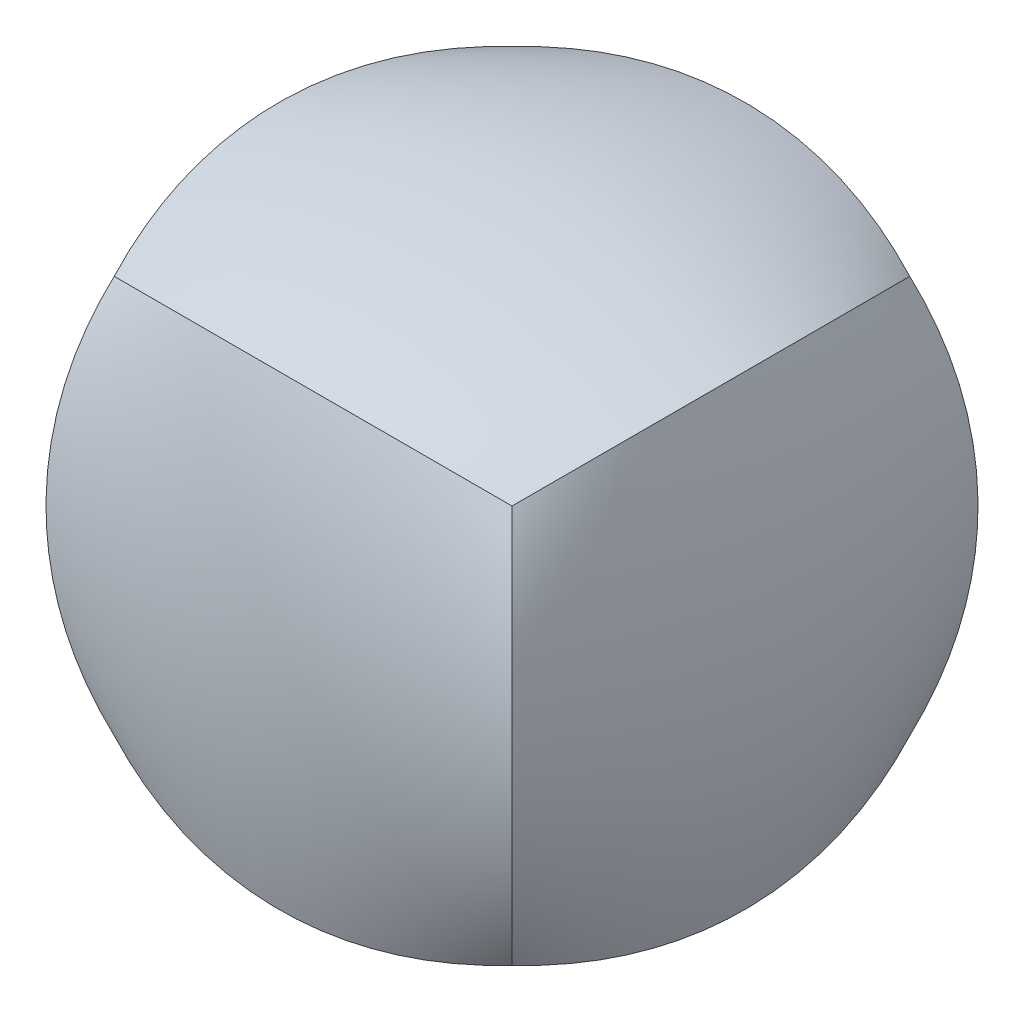
ISO-10303-21;
HEADER;
FILE_DESCRIPTION(('STEP AP214'),'2;1');
FILE_NAME('part.step','',(''),(''),'','','');
FILE_SCHEMA(('AUTOMOTIVE_DESIGN { 1 0 10303 214 1 1 1 1 }'));
ENDSEC;
DATA;
#1=APPLICATION_CONTEXT('core data for automotive mechanical design processes');
#2=APPLICATION_PROTOCOL_DEFINITION('international standard','automotive_design',2000,#1);
#3=PRODUCT_CONTEXT('',#1,'mechanical');
#4=PRODUCT('Part','Part','',(#3));
#5=PRODUCT_RELATED_PRODUCT_CATEGORY('part','',(#4));
#6=PRODUCT_DEFINITION_FORMATION('','',#4);
#7=PRODUCT_DEFINITION_CONTEXT('part definition',#1,'design');
#8=PRODUCT_DEFINITION('design','',#6,#7);
#9=PRODUCT_DEFINITION_SHAPE('','',#8);
#10=(LENGTH_UNIT() NAMED_UNIT(*) SI_UNIT(.MILLI.,.METRE.));
#11=(NAMED_UNIT(*) PLANE_ANGLE_UNIT() SI_UNIT($,.RADIAN.));
#12=(NAMED_UNIT(*) SI_UNIT($,.STERADIAN.) SOLID_ANGLE_UNIT());
#13=UNCERTAINTY_MEASURE_WITH_UNIT(LENGTH_MEASURE(1.E-05),#10,'distance_accuracy_value','');
#14=(GEOMETRIC_REPRESENTATION_CONTEXT(3) GLOBAL_UNCERTAINTY_ASSIGNED_CONTEXT((#13)) GLOBAL_UNIT_ASSIGNED_CONTEXT((#10,
#11,#12)) REPRESENTATION_CONTEXT('',''));
#15=CARTESIAN_POINT('',(0.,0.,0.));
#16=DIRECTION('',(0.,0.,1.));
#17=DIRECTION('',(1.,0.,0.));
#18=AXIS2_PLACEMENT_3D('',#15,#16,#17);
#19=CARTESIAN_POINT('',(12.7000000000001,-12.6999999999999,12.7));
#20=CARTESIAN_POINT('',(10.7341416421231,-13.3950358878535,13.3950358878536));
#21=CARTESIAN_POINT('',(6.59292560856888,-14.4939094954246,14.4939094954246));
#22=CARTESIAN_POINT('',(1.12185834828885E-13,-15.0719522391676,15.0719522391676));
#23=CARTESIAN_POINT('',(-6.59292560856865,-14.4939094954247,14.4939094954246));
#24=CARTESIAN_POINT('',(-10.7341416421229,-13.3950358878536,13.3950358878535));
#25=CARTESIAN_POINT('',(-12.6999999999999,-12.7000000000001,12.7));
#26=CARTESIAN_POINT('',(13.3950358878536,-13.3950358878534,10.734141642123));
#27=CARTESIAN_POINT('',(11.3017542838701,-14.090071775707,11.3017542838701));
#28=CARTESIAN_POINT('',(6.92306765529931,-15.1889453832781,12.1991677300531));
#29=CARTESIAN_POINT('',(1.14762422742295E-13,-15.7669881270211,12.6712359707765));
#30=CARTESIAN_POINT('',(-6.92306765529909,-15.1889453832782,12.1991677300531));
#31=CARTESIAN_POINT('',(-11.3017542838699,-14.0900717757071,11.30175428387));
#32=CARTESIAN_POINT('',(-13.3950358878534,-13.3950358878536,10.734141642123));
#33=CARTESIAN_POINT('',(14.4939094954247,-14.4939094954245,6.59292560856881));
#34=CARTESIAN_POINT('',(12.1991677300532,-15.1889453832781,6.92306765529924));
#35=CARTESIAN_POINT('',(7.44503261889558,-16.2878189908492,7.4450326188955));
#36=CARTESIAN_POINT('',(0.,-16.8658617345923,7.71960292217341));
#37=CARTESIAN_POINT('',(-7.44503261889539,-16.2878189908493,7.44503261889549));
#38=CARTESIAN_POINT('',(-12.199167730053,-15.1889453832783,6.92306765529921));
#39=CARTESIAN_POINT('',(-14.4939094954246,-14.4939094954248,6.59292560856877));
#40=CARTESIAN_POINT('',(15.0719522391677,-15.0719522391675,0.));
#41=CARTESIAN_POINT('',(12.6712359707767,-15.7669881270211,0.));
#42=CARTESIAN_POINT('',(7.71960292217354,-16.8658617345922,0.));
#43=CARTESIAN_POINT('',(1.56938354866308E-13,-17.4439044783352,0.));
#44=CARTESIAN_POINT('',(-7.71960292217323,-16.8658617345923,0.));
#45=CARTESIAN_POINT('',(-12.6712359707764,-15.7669881270212,0.));
#46=CARTESIAN_POINT('',(-15.0719522391675,-15.0719522391677,0.));
#47=CARTESIAN_POINT('',(14.4939094954247,-14.4939094954245,-6.59292560856875));
#48=CARTESIAN_POINT('',(12.1991677300532,-15.1889453832781,-6.92306765529918));
#49=CARTESIAN_POINT('',(7.44503261889558,-16.2878189908492,-7.44503261889547));
#50=CARTESIAN_POINT('',(1.03895963426386E-13,-16.8658617345922,-7.71960292217337));
#51=CARTESIAN_POINT('',(-7.44503261889538,-16.2878189908493,-7.44503261889547));
#52=CARTESIAN_POINT('',(-12.199167730053,-15.1889453832783,-6.92306765529919));
#53=CARTESIAN_POINT('',(-14.4939094954246,-14.4939094954248,-6.59292560856876));
#54=CARTESIAN_POINT('',(13.3950358878536,-13.3950358878535,-10.734141642123));
#55=CARTESIAN_POINT('',(11.3017542838701,-14.090071775707,-11.30175428387));
#56=CARTESIAN_POINT('',(6.92306765529932,-15.1889453832781,-12.1991677300531));
#57=CARTESIAN_POINT('',(1.12702438614572E-13,-15.7669881270212,-12.6712359707765));
#58=CARTESIAN_POINT('',(-6.9230676552991,-15.1889453832782,-12.1991677300531));
#59=CARTESIAN_POINT('',(-11.3017542838699,-14.0900717757071,-11.30175428387));
#60=CARTESIAN_POINT('',(-13.3950358878534,-13.3950358878536,-10.734141642123));
#61=CARTESIAN_POINT('',(12.7000000000001,-12.6999999999999,-12.7));
#62=CARTESIAN_POINT('',(10.7341416421231,-13.3950358878535,-13.3950358878535));
#63=CARTESIAN_POINT('',(6.59292560856889,-14.4939094954246,-14.4939094954246));
#64=CARTESIAN_POINT('',(1.12185834828885E-13,-15.0719522391676,-15.0719522391676));
#65=CARTESIAN_POINT('',(-6.59292560856868,-14.4939094954247,-14.4939094954246));
#66=CARTESIAN_POINT('',(-10.7341416421229,-13.3950358878536,-13.3950358878535));
#67=CARTESIAN_POINT('',(-12.6999999999999,-12.7000000000001,-12.7));
#68=B_SPLINE_SURFACE_WITH_KNOTS('',3,3,((#19,#20,#21,#22,#23,#24,#25),(#26,#27,#28,#29,#30,#31,
#32),(#33,#34,#35,#36,#37,#38,#39),(#40,#41,#42,#43,#44,#45,#46),(#47,#48,#49,#50,#51,#52,#53),
(#54,#55,#56,#57,#58,#59,#60),(#61,#62,#63,#64,#65,#66,#67)),.UNSPECIFIED.,.F.,.F.,.F.,(4,1,1,1,
4),(4,1,1,1,4),(0.,0.25,0.5,0.75,1.),(0.,0.25,0.5,0.75,1.),.UNSPECIFIED.);
#69=CARTESIAN_POINT('',(12.7000000000001,-12.6999999999998,12.7));
#70=CARTESIAN_POINT('',(13.3950358878537,-13.3950358878534,10.734141642123));
#71=CARTESIAN_POINT('',(14.4939094954248,-14.4939094954245,6.59292560856877));
#72=CARTESIAN_POINT('',(15.0719522391677,-15.0719522391674,0.));
#73=CARTESIAN_POINT('',(14.4939094954248,-14.4939094954245,-6.59292560856876));
#74=CARTESIAN_POINT('',(13.3950358878537,-13.3950358878534,-10.734141642123));
#75=CARTESIAN_POINT('',(12.7000000000001,-12.6999999999999,-12.7));
#76=B_SPLINE_CURVE_WITH_KNOTS('',3,(#69,#70,#71,#72,#73,#74,#75),.UNSPECIFIED.,.F.,.F.,(4,1,1,1,
4),(0.,0.25,0.5,0.75,1.),.UNSPECIFIED.);
#77=CARTESIAN_POINT('',(12.7,-12.6999999999999,12.7));
#78=VERTEX_POINT('',#77);
#79=CARTESIAN_POINT('',(12.7000000000001,-12.6999999999999,-12.7));
#80=VERTEX_POINT('',#79);
#81=EDGE_CURVE('E161',#78,#80,#76,.T.);
#82=CARTESIAN_POINT('',(12.6999999999999,-12.7,12.7000000000001));
#83=CARTESIAN_POINT('',(10.7341416421229,-13.3950358878536,13.3950358878536));
#84=CARTESIAN_POINT('',(6.59292560856866,-14.4939094954247,14.4939094954246));
#85=CARTESIAN_POINT('',(-1.23175941867931E-13,-15.0719522391677,15.0719522391676));
#86=CARTESIAN_POINT('',(-6.5929256085689,-14.4939094954247,14.4939094954245));
#87=CARTESIAN_POINT('',(-10.7341416421231,-13.3950358878536,13.3950358878534));
#88=CARTESIAN_POINT('',(-12.7000000000001,-12.7,12.6999999999998));
#89=B_SPLINE_CURVE_WITH_KNOTS('',3,(#82,#83,#84,#85,#86,#87,#88),.UNSPECIFIED.,.F.,.F.,(4,1,1,1,
4),(0.,0.25,0.5,0.75,1.),.UNSPECIFIED.);
#90=CARTESIAN_POINT('',(-12.7,-12.7,12.6999999999999));
#91=VERTEX_POINT('',#90);
#92=EDGE_CURVE('E203',#78,#91,#89,.T.);
#93=CARTESIAN_POINT('',(-12.6999999999999,-12.7,12.7));
#94=CARTESIAN_POINT('',(-13.3950358878535,-13.3950358878536,10.734141642123));
#95=CARTESIAN_POINT('',(-14.4939094954246,-14.4939094954247,6.59292560856881));
#96=CARTESIAN_POINT('',(-15.0719522391676,-15.0719522391677,0.));
#97=CARTESIAN_POINT('',(-14.4939094954246,-14.4939094954247,-6.59292560856875));
#98=CARTESIAN_POINT('',(-13.3950358878535,-13.3950358878536,-10.734141642123));
#99=CARTESIAN_POINT('',(-12.7,-12.7,-12.7));
#100=B_SPLINE_CURVE_WITH_KNOTS('',3,(#93,#94,#95,#96,#97,#98,#99),.UNSPECIFIED.,.F.,.F.,(4,1,1,
1,4),(0.,0.25,0.5,0.75,1.),.UNSPECIFIED.);
#101=CARTESIAN_POINT('',(-12.7,-12.7000000000001,-12.7));
#102=VERTEX_POINT('',#101);
#103=EDGE_CURVE('E255',#91,#102,#100,.T.);
#104=CARTESIAN_POINT('',(-12.7,-12.7,-12.7));
#105=CARTESIAN_POINT('',(-10.734141642123,-13.3950358878536,-13.3950358878535));
#106=CARTESIAN_POINT('',(-6.59292560856876,-14.4939094954247,-14.4939094954246));
#107=CARTESIAN_POINT('',(0.,-15.0719522391677,-15.0719522391676));
#108=CARTESIAN_POINT('',(6.5929256085688,-14.4939094954247,-14.4939094954245));
#109=CARTESIAN_POINT('',(10.734141642123,-13.3950358878536,-13.3950358878535));
#110=CARTESIAN_POINT('',(12.7,-12.7,-12.6999999999999));
#111=B_SPLINE_CURVE_WITH_KNOTS('',3,(#104,#105,#106,#107,#108,#109,#110),.UNSPECIFIED.,.F.,.F.,
(4,1,1,1,4),(0.,0.25,0.5,0.75,1.),.UNSPECIFIED.);
#112=EDGE_CURVE('E205',#102,#80,#111,.T.);
#113=ORIENTED_EDGE('',*,*,#81,.F.);
#114=ORIENTED_EDGE('',*,*,#92,.T.);
#115=ORIENTED_EDGE('',*,*,#103,.T.);
#116=ORIENTED_EDGE('',*,*,#112,.T.);
#117=EDGE_LOOP('',(#113,#114,#115,#116));
#118=FACE_BOUND('',#117,.T.);
#119=ADVANCED_FACE('F156',(#118),#68,.F.);
#120=CARTESIAN_POINT('',(12.6999999999999,12.7000000000001,12.7));
#121=CARTESIAN_POINT('',(13.3950358878534,10.7341416421231,13.3950358878536));
#122=CARTESIAN_POINT('',(14.4939094954246,6.59292560856893,14.4939094954246));
#123=CARTESIAN_POINT('',(15.0719522391676,1.64809305291374E-13,15.0719522391676));
#124=CARTESIAN_POINT('',(14.4939094954247,-6.5929256085686,14.4939094954246));
#125=CARTESIAN_POINT('',(13.3950358878536,-10.7341416421228,13.3950358878535));
#126=CARTESIAN_POINT('',(12.7000000000001,-12.6999999999998,12.7));
#127=CARTESIAN_POINT('',(13.3950358878534,13.3950358878537,10.734141642123));
#128=CARTESIAN_POINT('',(14.0900717757069,11.3017542838702,11.3017542838701));
#129=CARTESIAN_POINT('',(15.1889453832781,6.92306765529936,12.1991677300531));
#130=CARTESIAN_POINT('',(15.7669881270211,1.69812599442598E-13,12.6712359707765));
#131=CARTESIAN_POINT('',(15.1889453832782,-6.92306765529904,12.1991677300531));
#132=CARTESIAN_POINT('',(14.0900717757072,-11.3017542838699,11.30175428387));
#133=CARTESIAN_POINT('',(13.3950358878537,-13.3950358878534,10.734141642123));
#134=CARTESIAN_POINT('',(14.4939094954245,14.4939094954248,6.59292560856881));
#135=CARTESIAN_POINT('',(15.188945383278,12.1991677300533,6.92306765529924));
#136=CARTESIAN_POINT('',(16.2878189908492,7.44503261889563,7.4450326188955));
#137=CARTESIAN_POINT('',(16.8658617345923,1.56060785574076E-13,7.71960292217341));
#138=CARTESIAN_POINT('',(16.2878189908494,-7.44503261889533,7.44503261889549));
#139=CARTESIAN_POINT('',(15.1889453832783,-12.199167730053,6.92306765529921));
#140=CARTESIAN_POINT('',(14.4939094954248,-14.4939094954245,6.59292560856877));
#141=CARTESIAN_POINT('',(15.0719522391675,15.0719522391678,0.));
#142=CARTESIAN_POINT('',(15.766988127021,12.6712359707767,0.));
#143=CARTESIAN_POINT('',(16.8658617345922,7.7196029221736,0.));
#144=CARTESIAN_POINT('',(17.4439044783352,2.17843457105197E-13,0.));
#145=CARTESIAN_POINT('',(16.8658617345923,-7.71960292217317,0.));
#146=CARTESIAN_POINT('',(15.7669881270212,-12.6712359707763,0.));
#147=CARTESIAN_POINT('',(15.0719522391677,-15.0719522391674,0.));
#148=CARTESIAN_POINT('',(14.4939094954245,14.4939094954248,-6.59292560856875));
#149=CARTESIAN_POINT('',(15.188945383278,12.1991677300533,-6.92306765529918));
#150=CARTESIAN_POINT('',(16.2878189908492,7.44503261889564,-7.44503261889547));
#151=CARTESIAN_POINT('',(16.8658617345922,1.62782839043486E-13,-7.71960292217337));
#152=CARTESIAN_POINT('',(16.2878189908494,-7.44503261889533,-7.44503261889547));
#153=CARTESIAN_POINT('',(15.1889453832783,-12.199167730053,-6.92306765529919));
#154=CARTESIAN_POINT('',(14.4939094954248,-14.4939094954245,-6.59292560856876));
#155=CARTESIAN_POINT('',(13.3950358878534,13.3950358878537,-10.734141642123));
#156=CARTESIAN_POINT('',(14.090071775707,11.3017542838702,-11.30175428387));
#157=CARTESIAN_POINT('',(15.1889453832781,6.92306765529937,-12.1991677300531));
#158=CARTESIAN_POINT('',(15.7669881270212,1.67752615314876E-13,-12.6712359707765));
#159=CARTESIAN_POINT('',(15.1889453832783,-6.92306765529905,-12.1991677300531));
#160=CARTESIAN_POINT('',(14.0900717757072,-11.3017542838699,-11.30175428387));
#161=CARTESIAN_POINT('',(13.3950358878537,-13.3950358878534,-10.734141642123));
#162=CARTESIAN_POINT('',(12.6999999999999,12.7000000000001,-12.7));
#163=CARTESIAN_POINT('',(13.3950358878534,10.7341416421231,-13.3950358878535));
#164=CARTESIAN_POINT('',(14.4939094954246,6.59292560856893,-14.4939094954246));
#165=CARTESIAN_POINT('',(15.0719522391676,1.64809305291374E-13,-15.0719522391676));
#166=CARTESIAN_POINT('',(14.4939094954247,-6.59292560856863,-14.4939094954246));
#167=CARTESIAN_POINT('',(13.3950358878536,-10.7341416421229,-13.3950358878535));
#168=CARTESIAN_POINT('',(12.7000000000001,-12.6999999999999,-12.7));
#169=B_SPLINE_SURFACE_WITH_KNOTS('',3,3,((#120,#121,#122,#123,#124,#125,#126),(#127,#128,#129,
#130,#131,#132,#133),(#134,#135,#136,#137,#138,#139,#140),(#141,#142,#143,#144,#145,#146,#147),
(#148,#149,#150,#151,#152,#153,#154),(#155,#156,#157,#158,#159,#160,#161),(#162,#163,#164,#165,
#166,#167,#168)),.UNSPECIFIED.,.F.,.F.,.F.,(4,1,1,1,4),(4,1,1,1,4),(0.,0.25,0.5,0.75,1.),(0.,
0.25,0.5,0.75,1.),.UNSPECIFIED.);
#170=CARTESIAN_POINT('',(12.7,12.7,12.7));
#171=CARTESIAN_POINT('',(13.3950358878535,13.3950358878535,10.734141642123));
#172=CARTESIAN_POINT('',(14.4939094954247,14.4939094954247,6.59292560856877));
#173=CARTESIAN_POINT('',(15.0719522391676,15.0719522391676,0.));
#174=CARTESIAN_POINT('',(14.4939094954247,14.4939094954247,-6.59292560856876));
#175=CARTESIAN_POINT('',(13.3950358878535,13.3950358878535,-10.734141642123));
#176=CARTESIAN_POINT('',(12.7,12.7,-12.7));
#177=B_SPLINE_CURVE_WITH_KNOTS('',3,(#170,#171,#172,#173,#174,#175,#176),.UNSPECIFIED.,.F.,.F.,
(4,1,1,1,4),(0.,0.25,0.5,0.75,1.),.UNSPECIFIED.);
#178=CARTESIAN_POINT('',(12.6999999999999,12.7,12.7));
#179=VERTEX_POINT('',#178);
#180=CARTESIAN_POINT('',(12.6999999999999,12.7000000000001,-12.7));
#181=VERTEX_POINT('',#180);
#182=EDGE_CURVE('E220',#179,#181,#177,.T.);
#183=CARTESIAN_POINT('',(12.6999999999999,-12.7,12.7000000000001));
#184=CARTESIAN_POINT('',(13.3950358878534,-10.734141642123,13.3950358878536));
#185=CARTESIAN_POINT('',(14.4939094954245,-6.59292560856883,14.4939094954248));
#186=CARTESIAN_POINT('',(15.0719522391675,0.,15.0719522391678));
#187=CARTESIAN_POINT('',(14.4939094954245,6.5929256085687,14.4939094954248));
#188=CARTESIAN_POINT('',(13.3950358878534,10.7341416421229,13.3950358878537));
#189=CARTESIAN_POINT('',(12.6999999999998,12.6999999999999,12.7000000000001));
#190=B_SPLINE_CURVE_WITH_KNOTS('',3,(#183,#184,#185,#186,#187,#188,#189),.UNSPECIFIED.,.F.,.F.,
(4,1,1,1,4),(0.,0.25,0.5,0.75,1.),.UNSPECIFIED.);
#191=EDGE_CURVE('E207',#78,#179,#190,.T.);
#192=CARTESIAN_POINT('',(12.7,-12.7,-12.6999999999999));
#193=CARTESIAN_POINT('',(13.3950358878536,-10.734141642123,-13.3950358878535));
#194=CARTESIAN_POINT('',(14.4939094954247,-6.59292560856883,-14.4939094954246));
#195=CARTESIAN_POINT('',(15.0719522391676,0.,-15.0719522391676));
#196=CARTESIAN_POINT('',(14.4939094954247,6.59292560856873,-14.4939094954246));
#197=CARTESIAN_POINT('',(13.3950358878536,10.7341416421229,-13.3950358878535));
#198=CARTESIAN_POINT('',(12.7,12.7,-12.7));
#199=B_SPLINE_CURVE_WITH_KNOTS('',3,(#192,#193,#194,#195,#196,#197,#198),.UNSPECIFIED.,.F.,.F.,
(4,1,1,1,4),(0.,0.25,0.5,0.75,1.),.UNSPECIFIED.);
#200=EDGE_CURVE('E216',#80,#181,#199,.T.);
#201=ORIENTED_EDGE('',*,*,#182,.F.);
#202=ORIENTED_EDGE('',*,*,#191,.F.);
#203=ORIENTED_EDGE('',*,*,#81,.T.);
#204=ORIENTED_EDGE('',*,*,#200,.T.);
#205=EDGE_LOOP('',(#201,#202,#203,#204));
#206=FACE_BOUND('',#205,.T.);
#207=ADVANCED_FACE('F219',(#206),#169,.F.);
#208=CARTESIAN_POINT('',(12.6999999999999,-12.7,12.7000000000001));
#209=CARTESIAN_POINT('',(13.3950358878534,-10.734141642123,13.3950358878536));
#210=CARTESIAN_POINT('',(14.4939094954245,-6.59292560856883,14.4939094954248));
#211=CARTESIAN_POINT('',(15.0719522391675,0.,15.0719522391678));
#212=CARTESIAN_POINT('',(14.4939094954245,6.5929256085687,14.4939094954248));
#213=CARTESIAN_POINT('',(13.3950358878534,10.7341416421229,13.3950358878537));
#214=CARTESIAN_POINT('',(12.6999999999998,12.6999999999999,12.7000000000001));
#215=CARTESIAN_POINT('',(10.7341416421229,-13.3950358878536,13.3950358878536));
#216=CARTESIAN_POINT('',(11.3017542838699,-11.3017542838701,14.0900717757071));
#217=CARTESIAN_POINT('',(12.199167730053,-6.92306765529926,15.1889453832783));
#218=CARTESIAN_POINT('',(12.6712359707764,0.,15.7669881270213));
#219=CARTESIAN_POINT('',(12.199167730053,6.92306765529914,15.1889453832783));
#220=CARTESIAN_POINT('',(11.3017542838699,11.30175428387,14.0900717757072));
#221=CARTESIAN_POINT('',(10.7341416421228,13.3950358878535,13.3950358878537));
#222=CARTESIAN_POINT('',(6.59292560856866,-14.4939094954247,14.4939094954246));
#223=CARTESIAN_POINT('',(6.92306765529908,-12.1991677300532,15.1889453832782));
#224=CARTESIAN_POINT('',(7.44503261889533,-7.44503261889552,16.2878189908493));
#225=CARTESIAN_POINT('',(7.71960292217323,0.,16.8658617345923));
#226=CARTESIAN_POINT('',(7.44503261889532,7.44503261889545,16.2878189908494));
#227=CARTESIAN_POINT('',(6.92306765529905,12.1991677300531,15.1889453832783));
#228=CARTESIAN_POINT('',(6.59292560856862,14.4939094954246,14.4939094954248));
#229=CARTESIAN_POINT('',(-1.23175941867931E-13,-15.0719522391677,15.0719522391676));
#230=CARTESIAN_POINT('',(-1.31323422319363E-13,-12.6712359707766,15.7669881270211));
#231=CARTESIAN_POINT('',(-1.5953023252603E-13,-7.71960292217348,16.8658617345922));
#232=CARTESIAN_POINT('',(-1.62765986742933E-13,0.,17.4439044783352));
#233=CARTESIAN_POINT('',(-1.6625228599544E-13,7.71960292217329,16.8658617345923));
#234=CARTESIAN_POINT('',(-1.64283168362922E-13,12.6712359707764,15.7669881270212));
#235=CARTESIAN_POINT('',(-1.59605134863444E-13,15.0719522391675,15.0719522391676));
#236=CARTESIAN_POINT('',(-6.5929256085689,-14.4939094954247,14.4939094954245));
#237=CARTESIAN_POINT('',(-6.92306765529934,-12.1991677300531,15.188945383278));
#238=CARTESIAN_POINT('',(-7.44503261889564,-7.44503261889553,16.2878189908492));
#239=CARTESIAN_POINT('',(-7.71960292217354,0.,16.8658617345922));
#240=CARTESIAN_POINT('',(-7.44503261889564,7.44503261889544,16.2878189908492));
#241=CARTESIAN_POINT('',(-6.92306765529935,12.1991677300531,15.1889453832782));
#242=CARTESIAN_POINT('',(-6.59292560856892,14.4939094954246,14.4939094954246));
#243=CARTESIAN_POINT('',(-10.7341416421231,-13.3950358878536,13.3950358878534));
#244=CARTESIAN_POINT('',(-11.3017542838702,-11.3017542838701,14.0900717757069));
#245=CARTESIAN_POINT('',(-12.1991677300533,-6.92306765529926,15.188945383278));
#246=CARTESIAN_POINT('',(-12.6712359707767,0.,15.766988127021));
#247=CARTESIAN_POINT('',(-12.1991677300533,6.92306765529916,15.1889453832781));
#248=CARTESIAN_POINT('',(-11.3017542838702,11.30175428387,14.090071775707));
#249=CARTESIAN_POINT('',(-10.7341416421231,13.3950358878535,13.3950358878535));
#250=CARTESIAN_POINT('',(-12.7000000000001,-12.7,12.6999999999998));
#251=CARTESIAN_POINT('',(-13.3950358878536,-10.734141642123,13.3950358878534));
#252=CARTESIAN_POINT('',(-14.4939094954248,-6.59292560856883,14.4939094954245));
#253=CARTESIAN_POINT('',(-15.0719522391677,0.,15.0719522391675));
#254=CARTESIAN_POINT('',(-14.4939094954248,6.59292560856873,14.4939094954245));
#255=CARTESIAN_POINT('',(-13.3950358878537,10.7341416421229,13.3950358878534));
#256=CARTESIAN_POINT('',(-12.7000000000001,12.7,12.6999999999999));
#257=B_SPLINE_SURFACE_WITH_KNOTS('',3,3,((#208,#209,#210,#211,#212,#213,#214),(#215,#216,#217,
#218,#219,#220,#221),(#222,#223,#224,#225,#226,#227,#228),(#229,#230,#231,#232,#233,#234,#235),
(#236,#237,#238,#239,#240,#241,#242),(#243,#244,#245,#246,#247,#248,#249),(#250,#251,#252,#253,
#254,#255,#256)),.UNSPECIFIED.,.F.,.F.,.F.,(4,1,1,1,4),(4,1,1,1,4),(0.,0.25,0.5,0.75,1.),(0.,
0.25,0.5,0.75,1.),.UNSPECIFIED.);
#258=CARTESIAN_POINT('',(-12.7,12.7,12.7));
#259=CARTESIAN_POINT('',(-10.734141642123,13.3950358878535,13.3950358878536));
#260=CARTESIAN_POINT('',(-6.59292560856878,14.4939094954246,14.4939094954246));
#261=CARTESIAN_POINT('',(0.,15.0719522391676,15.0719522391676));
#262=CARTESIAN_POINT('',(6.59292560856876,14.4939094954246,14.4939094954246));
#263=CARTESIAN_POINT('',(10.734141642123,13.3950358878535,13.3950358878535));
#264=CARTESIAN_POINT('',(12.7,12.7,12.7));
#265=B_SPLINE_CURVE_WITH_KNOTS('',3,(#258,#259,#260,#261,#262,#263,#264),.UNSPECIFIED.,.F.,.F.,
(4,1,1,1,4),(0.,0.25,0.5,0.75,1.),.UNSPECIFIED.);
#266=CARTESIAN_POINT('',(-12.7000000000001,12.7,12.7));
#267=VERTEX_POINT('',#266);
#268=EDGE_CURVE('E277',#267,#179,#265,.T.);
#269=CARTESIAN_POINT('',(-12.6999999999999,-12.7,12.7));
#270=CARTESIAN_POINT('',(-13.3950358878535,-10.734141642123,13.3950358878536));
#271=CARTESIAN_POINT('',(-14.4939094954246,-6.59292560856883,14.4939094954246));
#272=CARTESIAN_POINT('',(-15.0719522391676,0.,15.0719522391676));
#273=CARTESIAN_POINT('',(-14.4939094954246,6.5929256085687,14.4939094954246));
#274=CARTESIAN_POINT('',(-13.3950358878535,10.7341416421229,13.3950358878535));
#275=CARTESIAN_POINT('',(-12.7,12.6999999999999,12.7));
#276=B_SPLINE_CURVE_WITH_KNOTS('',3,(#269,#270,#271,#272,#273,#274,#275),.UNSPECIFIED.,.F.,.F.,
(4,1,1,1,4),(0.,0.25,0.5,0.75,1.),.UNSPECIFIED.);
#277=EDGE_CURVE('E214',#91,#267,#276,.T.);
#278=ORIENTED_EDGE('',*,*,#92,.F.);
#279=ORIENTED_EDGE('',*,*,#191,.T.);
#280=ORIENTED_EDGE('',*,*,#268,.F.);
#281=ORIENTED_EDGE('',*,*,#277,.F.);
#282=EDGE_LOOP('',(#278,#279,#280,#281));
#283=FACE_BOUND('',#282,.T.);
#284=ADVANCED_FACE('F210',(#283),#257,.F.);
#285=CARTESIAN_POINT('',(-12.7,-12.7,-12.7));
#286=CARTESIAN_POINT('',(-13.3950358878535,-10.734141642123,-13.3950358878535));
#287=CARTESIAN_POINT('',(-14.4939094954246,-6.59292560856883,-14.4939094954247));
#288=CARTESIAN_POINT('',(-15.0719522391676,0.,-15.0719522391676));
#289=CARTESIAN_POINT('',(-14.4939094954246,6.5929256085687,-14.4939094954247));
#290=CARTESIAN_POINT('',(-13.3950358878535,10.7341416421229,-13.3950358878536));
#291=CARTESIAN_POINT('',(-12.6999999999999,12.6999999999999,-12.7000000000001));
#292=CARTESIAN_POINT('',(-10.734141642123,-13.3950358878536,-13.3950358878535));
#293=CARTESIAN_POINT('',(-11.30175428387,-11.3017542838701,-14.0900717757071));
#294=CARTESIAN_POINT('',(-12.1991677300531,-6.92306765529926,-15.1889453832782));
#295=CARTESIAN_POINT('',(-12.6712359707765,0.,-15.7669881270212));
#296=CARTESIAN_POINT('',(-12.1991677300531,6.92306765529914,-15.1889453832782));
#297=CARTESIAN_POINT('',(-11.30175428387,11.30175428387,-14.0900717757071));
#298=CARTESIAN_POINT('',(-10.7341416421229,13.3950358878535,-13.3950358878536));
#299=CARTESIAN_POINT('',(-6.59292560856876,-14.4939094954247,-14.4939094954246));
#300=CARTESIAN_POINT('',(-6.92306765529919,-12.1991677300532,-15.1889453832781));
#301=CARTESIAN_POINT('',(-7.44503261889544,-7.44503261889552,-16.2878189908493));
#302=CARTESIAN_POINT('',(-7.71960292217335,0.,-16.8658617345923));
#303=CARTESIAN_POINT('',(-7.44503261889543,7.44503261889545,-16.2878189908493));
#304=CARTESIAN_POINT('',(-6.92306765529916,12.1991677300531,-15.1889453832783));
#305=CARTESIAN_POINT('',(-6.59292560856872,14.4939094954246,-14.4939094954247));
#306=CARTESIAN_POINT('',(0.,-15.0719522391677,-15.0719522391676));
#307=CARTESIAN_POINT('',(0.,-12.6712359707766,-15.7669881270211));
#308=CARTESIAN_POINT('',(0.,-7.71960292217348,-16.8658617345922));
#309=CARTESIAN_POINT('',(0.,0.,-17.4439044783352));
#310=CARTESIAN_POINT('',(0.,7.71960292217329,-16.8658617345923));
#311=CARTESIAN_POINT('',(0.,12.6712359707764,-15.7669881270212));
#312=CARTESIAN_POINT('',(0.,15.0719522391675,-15.0719522391676));
#313=CARTESIAN_POINT('',(6.5929256085688,-14.4939094954247,-14.4939094954245));
#314=CARTESIAN_POINT('',(6.92306765529923,-12.1991677300531,-15.1889453832781));
#315=CARTESIAN_POINT('',(7.44503261889553,-7.44503261889553,-16.2878189908492));
#316=CARTESIAN_POINT('',(7.71960292217343,0.,-16.8658617345922));
#317=CARTESIAN_POINT('',(7.44503261889552,7.44503261889544,-16.2878189908493));
#318=CARTESIAN_POINT('',(6.92306765529925,12.1991677300531,-15.1889453832782));
#319=CARTESIAN_POINT('',(6.59292560856882,14.4939094954246,-14.4939094954247));
#320=CARTESIAN_POINT('',(10.734141642123,-13.3950358878536,-13.3950358878535));
#321=CARTESIAN_POINT('',(11.3017542838701,-11.3017542838701,-14.090071775707));
#322=CARTESIAN_POINT('',(12.1991677300532,-6.92306765529926,-15.1889453832781));
#323=CARTESIAN_POINT('',(12.6712359707766,0.,-15.7669881270211));
#324=CARTESIAN_POINT('',(12.1991677300532,6.92306765529916,-15.1889453832782));
#325=CARTESIAN_POINT('',(11.3017542838701,11.30175428387,-14.0900717757071));
#326=CARTESIAN_POINT('',(10.734141642123,13.3950358878535,-13.3950358878535));
#327=CARTESIAN_POINT('',(12.7,-12.7,-12.6999999999999));
#328=CARTESIAN_POINT('',(13.3950358878536,-10.734141642123,-13.3950358878535));
#329=CARTESIAN_POINT('',(14.4939094954247,-6.59292560856883,-14.4939094954246));
#330=CARTESIAN_POINT('',(15.0719522391676,0.,-15.0719522391676));
#331=CARTESIAN_POINT('',(14.4939094954247,6.59292560856873,-14.4939094954246));
#332=CARTESIAN_POINT('',(13.3950358878536,10.7341416421229,-13.3950358878535));
#333=CARTESIAN_POINT('',(12.7,12.7,-12.7));
#334=B_SPLINE_SURFACE_WITH_KNOTS('',3,3,((#285,#286,#287,#288,#289,#290,#291),(#292,#293,#294,
#295,#296,#297,#298),(#299,#300,#301,#302,#303,#304,#305),(#306,#307,#308,#309,#310,#311,#312),
(#313,#314,#315,#316,#317,#318,#319),(#320,#321,#322,#323,#324,#325,#326),(#327,#328,#329,#330,
#331,#332,#333)),.UNSPECIFIED.,.F.,.F.,.F.,(4,1,1,1,4),(4,1,1,1,4),(0.,0.25,0.5,0.75,1.),(0.,
0.25,0.5,0.75,1.),.UNSPECIFIED.);
#335=CARTESIAN_POINT('',(-12.7,-12.7,-12.7));
#336=CARTESIAN_POINT('',(-13.3950358878535,-10.734141642123,-13.3950358878535));
#337=CARTESIAN_POINT('',(-14.4939094954246,-6.59292560856883,-14.4939094954246));
#338=CARTESIAN_POINT('',(-15.0719522391676,0.,-15.0719522391676));
#339=CARTESIAN_POINT('',(-14.4939094954247,6.59292560856873,-14.4939094954246));
#340=CARTESIAN_POINT('',(-13.3950358878536,10.7341416421229,-13.3950358878535));
#341=CARTESIAN_POINT('',(-12.7,12.7,-12.7));
#342=B_SPLINE_CURVE_WITH_KNOTS('',3,(#335,#336,#337,#338,#339,#340,#341),.UNSPECIFIED.,.F.,.F.,
(4,1,1,1,4),(0.,0.25,0.5,0.75,1.),.UNSPECIFIED.);
#343=CARTESIAN_POINT('',(-12.7,12.7,-12.7));
#344=VERTEX_POINT('',#343);
#345=EDGE_CURVE('E247',#102,#344,#342,.T.);
#346=CARTESIAN_POINT('',(-12.7,12.7,-12.7));
#347=CARTESIAN_POINT('',(-10.734141642123,13.3950358878535,-13.3950358878535));
#348=CARTESIAN_POINT('',(-6.59292560856878,14.4939094954247,-14.4939094954246));
#349=CARTESIAN_POINT('',(0.,15.0719522391676,-15.0719522391676));
#350=CARTESIAN_POINT('',(6.59292560856878,14.4939094954246,-14.4939094954246));
#351=CARTESIAN_POINT('',(10.734141642123,13.3950358878535,-13.3950358878535));
#352=CARTESIAN_POINT('',(12.7,12.7,-12.7));
#353=B_SPLINE_CURVE_WITH_KNOTS('',3,(#346,#347,#348,#349,#350,#351,#352),.UNSPECIFIED.,.F.,.F.,
(4,1,1,1,4),(0.,0.25,0.5,0.75,1.),.UNSPECIFIED.);
#354=EDGE_CURVE('E170',#344,#181,#353,.T.);
#355=ORIENTED_EDGE('',*,*,#112,.F.);
#356=ORIENTED_EDGE('',*,*,#345,.T.);
#357=ORIENTED_EDGE('',*,*,#354,.T.);
#358=ORIENTED_EDGE('',*,*,#200,.F.);
#359=EDGE_LOOP('',(#355,#356,#357,#358));
#360=FACE_BOUND('',#359,.T.);
#361=ADVANCED_FACE('F305',(#360),#334,.F.);
#362=CARTESIAN_POINT('',(-12.6999999999999,-12.7,12.7));
#363=CARTESIAN_POINT('',(-13.3950358878535,-10.734141642123,13.3950358878536));
#364=CARTESIAN_POINT('',(-14.4939094954246,-6.59292560856883,14.4939094954246));
#365=CARTESIAN_POINT('',(-15.0719522391676,0.,15.0719522391676));
#366=CARTESIAN_POINT('',(-14.4939094954246,6.5929256085687,14.4939094954246));
#367=CARTESIAN_POINT('',(-13.3950358878535,10.7341416421229,13.3950358878535));
#368=CARTESIAN_POINT('',(-12.7,12.6999999999999,12.7));
#369=CARTESIAN_POINT('',(-13.3950358878535,-13.3950358878536,10.734141642123));
#370=CARTESIAN_POINT('',(-14.090071775707,-11.3017542838701,11.3017542838701));
#371=CARTESIAN_POINT('',(-15.1889453832781,-6.92306765529926,12.1991677300531));
#372=CARTESIAN_POINT('',(-15.7669881270211,0.,12.6712359707765));
#373=CARTESIAN_POINT('',(-15.1889453832782,6.92306765529914,12.1991677300531));
#374=CARTESIAN_POINT('',(-14.0900717757071,11.30175428387,11.30175428387));
#375=CARTESIAN_POINT('',(-13.3950358878536,13.3950358878535,10.734141642123));
#376=CARTESIAN_POINT('',(-14.4939094954246,-14.4939094954247,6.59292560856881));
#377=CARTESIAN_POINT('',(-15.1889453832781,-12.1991677300532,6.92306765529924));
#378=CARTESIAN_POINT('',(-16.2878189908493,-7.44503261889552,7.4450326188955));
#379=CARTESIAN_POINT('',(-16.8658617345923,0.,7.71960292217341));
#380=CARTESIAN_POINT('',(-16.2878189908493,7.44503261889545,7.44503261889549));
#381=CARTESIAN_POINT('',(-15.1889453832782,12.1991677300531,6.92306765529921));
#382=CARTESIAN_POINT('',(-14.4939094954247,14.4939094954246,6.59292560856877));
#383=CARTESIAN_POINT('',(-15.0719522391676,-15.0719522391677,0.));
#384=CARTESIAN_POINT('',(-15.7669881270211,-12.6712359707766,0.));
#385=CARTESIAN_POINT('',(-16.8658617345922,-7.71960292217348,0.));
#386=CARTESIAN_POINT('',(-17.4439044783352,0.,0.));
#387=CARTESIAN_POINT('',(-16.8658617345923,7.71960292217329,0.));
#388=CARTESIAN_POINT('',(-15.7669881270212,12.6712359707764,0.));
#389=CARTESIAN_POINT('',(-15.0719522391676,15.0719522391675,0.));
#390=CARTESIAN_POINT('',(-14.4939094954246,-14.4939094954247,-6.59292560856875));
#391=CARTESIAN_POINT('',(-15.1889453832781,-12.1991677300531,-6.92306765529918));
#392=CARTESIAN_POINT('',(-16.2878189908492,-7.44503261889553,-7.44503261889547));
#393=CARTESIAN_POINT('',(-16.8658617345922,0.,-7.71960292217337));
#394=CARTESIAN_POINT('',(-16.2878189908493,7.44503261889544,-7.44503261889547));
#395=CARTESIAN_POINT('',(-15.1889453832782,12.1991677300531,-6.92306765529919));
#396=CARTESIAN_POINT('',(-14.4939094954247,14.4939094954246,-6.59292560856876));
#397=CARTESIAN_POINT('',(-13.3950358878535,-13.3950358878536,-10.734141642123));
#398=CARTESIAN_POINT('',(-14.090071775707,-11.3017542838701,-11.30175428387));
#399=CARTESIAN_POINT('',(-15.1889453832782,-6.92306765529926,-12.1991677300531));
#400=CARTESIAN_POINT('',(-15.7669881270212,0.,-12.6712359707765));
#401=CARTESIAN_POINT('',(-15.1889453832782,6.92306765529916,-12.1991677300531));
#402=CARTESIAN_POINT('',(-14.0900717757071,11.30175428387,-11.30175428387));
#403=CARTESIAN_POINT('',(-13.3950358878536,13.3950358878535,-10.734141642123));
#404=CARTESIAN_POINT('',(-12.7,-12.7,-12.7));
#405=CARTESIAN_POINT('',(-13.3950358878535,-10.734141642123,-13.3950358878535));
#406=CARTESIAN_POINT('',(-14.4939094954246,-6.59292560856883,-14.4939094954246));
#407=CARTESIAN_POINT('',(-15.0719522391676,0.,-15.0719522391676));
#408=CARTESIAN_POINT('',(-14.4939094954247,6.59292560856873,-14.4939094954246));
#409=CARTESIAN_POINT('',(-13.3950358878536,10.7341416421229,-13.3950358878535));
#410=CARTESIAN_POINT('',(-12.7,12.7,-12.7));
#411=B_SPLINE_SURFACE_WITH_KNOTS('',3,3,((#362,#363,#364,#365,#366,#367,#368),(#369,#370,#371,
#372,#373,#374,#375),(#376,#377,#378,#379,#380,#381,#382),(#383,#384,#385,#386,#387,#388,#389),
(#390,#391,#392,#393,#394,#395,#396),(#397,#398,#399,#400,#401,#402,#403),(#404,#405,#406,#407,
#408,#409,#410)),.UNSPECIFIED.,.F.,.F.,.F.,(4,1,1,1,4),(4,1,1,1,4),(0.,0.25,0.5,0.75,1.),(0.,
0.25,0.5,0.75,1.),.UNSPECIFIED.);
#412=CARTESIAN_POINT('',(-12.7,12.7,12.7));
#413=CARTESIAN_POINT('',(-13.3950358878535,13.3950358878535,10.734141642123));
#414=CARTESIAN_POINT('',(-14.4939094954246,14.4939094954246,6.59292560856881));
#415=CARTESIAN_POINT('',(-15.0719522391676,15.0719522391676,0.));
#416=CARTESIAN_POINT('',(-14.4939094954246,14.4939094954246,-6.59292560856875));
#417=CARTESIAN_POINT('',(-13.3950358878535,13.3950358878535,-10.734141642123));
#418=CARTESIAN_POINT('',(-12.7,12.7,-12.7));
#419=B_SPLINE_CURVE_WITH_KNOTS('',3,(#412,#413,#414,#415,#416,#417,#418),.UNSPECIFIED.,.F.,.F.,
(4,1,1,1,4),(0.,0.25,0.5,0.75,1.),.UNSPECIFIED.);
#420=EDGE_CURVE('E12',#267,#344,#419,.T.);
#421=ORIENTED_EDGE('',*,*,#103,.F.);
#422=ORIENTED_EDGE('',*,*,#277,.T.);
#423=ORIENTED_EDGE('',*,*,#420,.T.);
#424=ORIENTED_EDGE('',*,*,#345,.F.);
#425=EDGE_LOOP('',(#421,#422,#423,#424));
#426=FACE_BOUND('',#425,.T.);
#427=ADVANCED_FACE('F308',(#426),#411,.F.);
#428=CARTESIAN_POINT('',(-12.7,12.7,12.7));
#429=CARTESIAN_POINT('',(-10.734141642123,13.3950358878535,13.3950358878536));
#430=CARTESIAN_POINT('',(-6.59292560856878,14.4939094954246,14.4939094954246));
#431=CARTESIAN_POINT('',(0.,15.0719522391676,15.0719522391676));
#432=CARTESIAN_POINT('',(6.59292560856876,14.4939094954246,14.4939094954246));
#433=CARTESIAN_POINT('',(10.734141642123,13.3950358878535,13.3950358878535));
#434=CARTESIAN_POINT('',(12.7,12.7,12.7));
#435=CARTESIAN_POINT('',(-13.3950358878535,13.3950358878535,10.734141642123));
#436=CARTESIAN_POINT('',(-11.30175428387,14.0900717757071,11.3017542838701));
#437=CARTESIAN_POINT('',(-6.92306765529921,15.1889453832782,12.1991677300531));
#438=CARTESIAN_POINT('',(0.,15.7669881270211,12.6712359707765));
#439=CARTESIAN_POINT('',(6.9230676552992,15.1889453832782,12.1991677300531));
#440=CARTESIAN_POINT('',(11.30175428387,14.0900717757071,11.30175428387));
#441=CARTESIAN_POINT('',(13.3950358878535,13.3950358878535,10.734141642123));
#442=CARTESIAN_POINT('',(-14.4939094954246,14.4939094954246,6.59292560856881));
#443=CARTESIAN_POINT('',(-12.1991677300531,15.1889453832782,6.92306765529924));
#444=CARTESIAN_POINT('',(-7.44503261889546,16.2878189908493,7.4450326188955));
#445=CARTESIAN_POINT('',(0.,16.8658617345923,7.71960292217341));
#446=CARTESIAN_POINT('',(7.4450326188955,16.2878189908493,7.44503261889549));
#447=CARTESIAN_POINT('',(12.1991677300531,15.1889453832782,6.92306765529921));
#448=CARTESIAN_POINT('',(14.4939094954247,14.4939094954247,6.59292560856877));
#449=CARTESIAN_POINT('',(-15.0719522391676,15.0719522391676,0.));
#450=CARTESIAN_POINT('',(-12.6712359707766,15.7669881270212,0.));
#451=CARTESIAN_POINT('',(-7.71960292217342,16.8658617345923,0.));
#452=CARTESIAN_POINT('',(0.,17.4439044783352,0.));
#453=CARTESIAN_POINT('',(7.71960292217335,16.8658617345922,0.));
#454=CARTESIAN_POINT('',(12.6712359707765,15.7669881270211,0.));
#455=CARTESIAN_POINT('',(15.0719522391676,15.0719522391676,0.));
#456=CARTESIAN_POINT('',(-14.4939094954246,14.4939094954246,-6.59292560856875));
#457=CARTESIAN_POINT('',(-12.1991677300531,15.1889453832782,-6.92306765529918));
#458=CARTESIAN_POINT('',(-7.44503261889547,16.2878189908493,-7.44503261889547));
#459=CARTESIAN_POINT('',(0.,16.8658617345922,-7.71960292217337));
#460=CARTESIAN_POINT('',(7.4450326188955,16.2878189908493,-7.44503261889547));
#461=CARTESIAN_POINT('',(12.1991677300531,15.1889453832782,-6.92306765529919));
#462=CARTESIAN_POINT('',(14.4939094954247,14.4939094954247,-6.59292560856876));
#463=CARTESIAN_POINT('',(-13.3950358878535,13.3950358878535,-10.734141642123));
#464=CARTESIAN_POINT('',(-11.30175428387,14.0900717757071,-11.30175428387));
#465=CARTESIAN_POINT('',(-6.92306765529921,15.1889453832782,-12.1991677300531));
#466=CARTESIAN_POINT('',(0.,15.7669881270212,-12.6712359707765));
#467=CARTESIAN_POINT('',(6.92306765529921,15.1889453832782,-12.1991677300531));
#468=CARTESIAN_POINT('',(11.30175428387,14.0900717757071,-11.30175428387));
#469=CARTESIAN_POINT('',(13.3950358878535,13.3950358878535,-10.734141642123));
#470=CARTESIAN_POINT('',(-12.7,12.7,-12.7));
#471=CARTESIAN_POINT('',(-10.734141642123,13.3950358878535,-13.3950358878535));
#472=CARTESIAN_POINT('',(-6.59292560856878,14.4939094954247,-14.4939094954246));
#473=CARTESIAN_POINT('',(0.,15.0719522391676,-15.0719522391676));
#474=CARTESIAN_POINT('',(6.59292560856878,14.4939094954246,-14.4939094954246));
#475=CARTESIAN_POINT('',(10.734141642123,13.3950358878535,-13.3950358878535));
#476=CARTESIAN_POINT('',(12.7,12.7,-12.7));
#477=B_SPLINE_SURFACE_WITH_KNOTS('',3,3,((#428,#429,#430,#431,#432,#433,#434),(#435,#436,#437,
#438,#439,#440,#441),(#442,#443,#444,#445,#446,#447,#448),(#449,#450,#451,#452,#453,#454,#455),
(#456,#457,#458,#459,#460,#461,#462),(#463,#464,#465,#466,#467,#468,#469),(#470,#471,#472,#473,
#474,#475,#476)),.UNSPECIFIED.,.F.,.F.,.F.,(4,1,1,1,4),(4,1,1,1,4),(0.,0.25,0.5,0.75,1.),(0.,
0.25,0.5,0.75,1.),.UNSPECIFIED.);
#478=ORIENTED_EDGE('',*,*,#420,.F.);
#479=ORIENTED_EDGE('',*,*,#268,.T.);
#480=ORIENTED_EDGE('',*,*,#182,.T.);
#481=ORIENTED_EDGE('',*,*,#354,.F.);
#482=EDGE_LOOP('',(#478,#479,#480,#481));
#483=FACE_BOUND('',#482,.T.);
#484=ADVANCED_FACE('F303',(#483),#477,.F.);
#485=CLOSED_SHELL('',(#119,#207,#284,#361,#427,#484));
#486=MANIFOLD_SOLID_BREP('B2',#485);
#487=ADVANCED_BREP_SHAPE_REPRESENTATION('',(#18,#486),#14);
#488=SHAPE_DEFINITION_REPRESENTATION(#9,#487);
ENDSEC;
END-ISO-10303-21;
